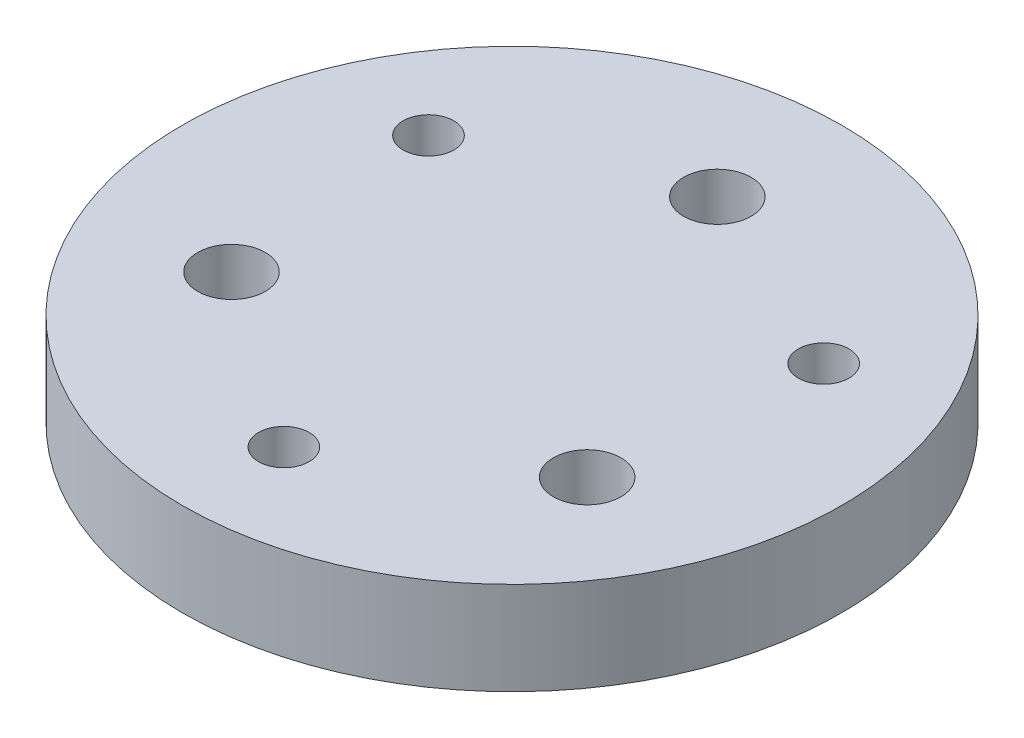
ISO-10303-21;
HEADER;
FILE_DESCRIPTION(('STEP AP214'),'2;1');
FILE_NAME('part.step','',(''),(''),'','','');
FILE_SCHEMA(('AUTOMOTIVE_DESIGN { 1 0 10303 214 1 1 1 1 }'));
ENDSEC;
DATA;
#1=APPLICATION_CONTEXT('core data for automotive mechanical design processes');
#2=APPLICATION_PROTOCOL_DEFINITION('international standard','automotive_design',2000,#1);
#3=PRODUCT_CONTEXT('',#1,'mechanical');
#4=PRODUCT('Part','Part','',(#3));
#5=PRODUCT_RELATED_PRODUCT_CATEGORY('part','',(#4));
#6=PRODUCT_DEFINITION_FORMATION('','',#4);
#7=PRODUCT_DEFINITION_CONTEXT('part definition',#1,'design');
#8=PRODUCT_DEFINITION('design','',#6,#7);
#9=PRODUCT_DEFINITION_SHAPE('','',#8);
#10=(LENGTH_UNIT() NAMED_UNIT(*) SI_UNIT(.MILLI.,.METRE.));
#11=(NAMED_UNIT(*) PLANE_ANGLE_UNIT() SI_UNIT($,.RADIAN.));
#12=(NAMED_UNIT(*) SI_UNIT($,.STERADIAN.) SOLID_ANGLE_UNIT());
#13=UNCERTAINTY_MEASURE_WITH_UNIT(LENGTH_MEASURE(1.E-05),#10,'distance_accuracy_value','');
#14=(GEOMETRIC_REPRESENTATION_CONTEXT(3) GLOBAL_UNCERTAINTY_ASSIGNED_CONTEXT((#13)) GLOBAL_UNIT_ASSIGNED_CONTEXT((#10,
#11,#12)) REPRESENTATION_CONTEXT('',''));
#15=CARTESIAN_POINT('',(0.,0.,0.));
#16=DIRECTION('',(0.,0.,1.));
#17=DIRECTION('',(1.,0.,0.));
#18=AXIS2_PLACEMENT_3D('',#15,#16,#17);
#19=CARTESIAN_POINT('',(0.,5.5,0.));
#20=DIRECTION('',(0.,1.,0.));
#21=DIRECTION('',(0.,0.,1.));
#22=AXIS2_PLACEMENT_3D('',#19,#20,#21);
#23=PLANE('',#22);
#24=CARTESIAN_POINT('',(0.,5.5,13.5));
#25=DIRECTION('',(0.,1.,0.));
#26=DIRECTION('',(0.,0.,1.));
#27=AXIS2_PLACEMENT_3D('',#24,#25,#26);
#28=CIRCLE('',#27,1.5);
#29=CARTESIAN_POINT('',(0.,5.5,15.));
#30=VERTEX_POINT('',#29);
#31=EDGE_CURVE('E65',#30,#30,#28,.T.);
#32=ORIENTED_EDGE('',*,*,#31,.F.);
#33=EDGE_LOOP('',(#32));
#34=FACE_BOUND('',#33,.T.);
#35=CARTESIAN_POINT('',(10.5222086559809,5.5,6.075));
#36=DIRECTION('',(0.,1.,0.));
#37=DIRECTION('',(0.,0.,1.));
#38=AXIS2_PLACEMENT_3D('',#35,#36,#37);
#39=CIRCLE('',#38,2.);
#40=CARTESIAN_POINT('',(10.5222086559809,5.5,8.075));
#41=VERTEX_POINT('',#40);
#42=EDGE_CURVE('E53',#41,#41,#39,.T.);
#43=ORIENTED_EDGE('',*,*,#42,.F.);
#44=EDGE_LOOP('',(#43));
#45=FACE_BOUND('',#44,.T.);
#46=CARTESIAN_POINT('',(0.,5.5,-12.15));
#47=DIRECTION('',(0.,1.,0.));
#48=DIRECTION('',(0.,0.,1.));
#49=AXIS2_PLACEMENT_3D('',#46,#47,#48);
#50=CIRCLE('',#49,2.);
#51=CARTESIAN_POINT('',(0.,5.5,-10.15));
#52=VERTEX_POINT('',#51);
#53=EDGE_CURVE('E42',#52,#52,#50,.T.);
#54=ORIENTED_EDGE('',*,*,#53,.F.);
#55=EDGE_LOOP('',(#54));
#56=FACE_BOUND('',#55,.T.);
#57=CARTESIAN_POINT('',(0.,5.5,0.));
#58=DIRECTION('',(0.,1.,0.));
#59=DIRECTION('',(0.,0.,1.));
#60=AXIS2_PLACEMENT_3D('',#57,#58,#59);
#61=CIRCLE('',#60,19.5);
#62=CARTESIAN_POINT('',(0.,5.5,19.5));
#63=VERTEX_POINT('',#62);
#64=EDGE_CURVE('E10',#63,#63,#61,.T.);
#65=ORIENTED_EDGE('',*,*,#64,.T.);
#66=EDGE_LOOP('',(#65));
#67=FACE_BOUND('',#66,.T.);
#68=CARTESIAN_POINT('',(-10.5222086559809,5.5,6.075));
#69=DIRECTION('',(0.,1.,0.));
#70=DIRECTION('',(0.,0.,1.));
#71=AXIS2_PLACEMENT_3D('',#68,#69,#70);
#72=CIRCLE('',#71,2.);
#73=CARTESIAN_POINT('',(-10.5222086559809,5.5,8.075));
#74=VERTEX_POINT('',#73);
#75=EDGE_CURVE('E47',#74,#74,#72,.T.);
#76=ORIENTED_EDGE('',*,*,#75,.F.);
#77=EDGE_LOOP('',(#76));
#78=FACE_BOUND('',#77,.T.);
#79=CARTESIAN_POINT('',(-11.6913429510899,5.5,-6.75000000000001));
#80=DIRECTION('',(0.,1.,0.));
#81=DIRECTION('',(0.,0.,1.));
#82=AXIS2_PLACEMENT_3D('',#79,#80,#81);
#83=CIRCLE('',#82,1.5);
#84=CARTESIAN_POINT('',(-11.6913429510899,5.5,-5.25000000000001));
#85=VERTEX_POINT('',#84);
#86=EDGE_CURVE('E59',#85,#85,#83,.T.);
#87=ORIENTED_EDGE('',*,*,#86,.F.);
#88=EDGE_LOOP('',(#87));
#89=FACE_BOUND('',#88,.T.);
#90=CARTESIAN_POINT('',(11.6913429510899,5.5,-6.75000000000001));
#91=DIRECTION('',(0.,1.,0.));
#92=DIRECTION('',(0.,0.,1.));
#93=AXIS2_PLACEMENT_3D('',#90,#91,#92);
#94=CIRCLE('',#93,1.5);
#95=CARTESIAN_POINT('',(11.6913429510899,5.5,-5.25000000000001));
#96=VERTEX_POINT('',#95);
#97=EDGE_CURVE('E71',#96,#96,#94,.T.);
#98=ORIENTED_EDGE('',*,*,#97,.F.);
#99=EDGE_LOOP('',(#98));
#100=FACE_BOUND('',#99,.T.);
#101=ADVANCED_FACE('F31',(#34,#45,#56,#67,#78,#89,#100),#23,.T.);
#102=CARTESIAN_POINT('',(0.,0.,0.));
#103=DIRECTION('',(0.,1.,0.));
#104=DIRECTION('',(0.,0.,1.));
#105=AXIS2_PLACEMENT_3D('',#102,#103,#104);
#106=PLANE('',#105);
#107=CARTESIAN_POINT('',(0.,0.,0.));
#108=DIRECTION('',(0.,1.,0.));
#109=DIRECTION('',(0.,0.,1.));
#110=AXIS2_PLACEMENT_3D('',#107,#108,#109);
#111=CIRCLE('',#110,19.5);
#112=CARTESIAN_POINT('',(0.,0.,19.5));
#113=VERTEX_POINT('',#112);
#114=EDGE_CURVE('E35',#113,#113,#111,.T.);
#115=ORIENTED_EDGE('',*,*,#114,.F.);
#116=EDGE_LOOP('',(#115));
#117=FACE_BOUND('',#116,.T.);
#118=CARTESIAN_POINT('',(0.,0.,-12.15));
#119=DIRECTION('',(0.,1.,0.));
#120=DIRECTION('',(0.,0.,1.));
#121=AXIS2_PLACEMENT_3D('',#118,#119,#120);
#122=CIRCLE('',#121,2.);
#123=CARTESIAN_POINT('',(0.,0.,-10.15));
#124=VERTEX_POINT('',#123);
#125=EDGE_CURVE('E44',#124,#124,#122,.T.);
#126=ORIENTED_EDGE('',*,*,#125,.T.);
#127=EDGE_LOOP('',(#126));
#128=FACE_BOUND('',#127,.T.);
#129=CARTESIAN_POINT('',(-10.5222086559809,0.,6.075));
#130=DIRECTION('',(0.,1.,0.));
#131=DIRECTION('',(0.,0.,1.));
#132=AXIS2_PLACEMENT_3D('',#129,#130,#131);
#133=CIRCLE('',#132,2.);
#134=CARTESIAN_POINT('',(-10.5222086559809,0.,8.075));
#135=VERTEX_POINT('',#134);
#136=EDGE_CURVE('E50',#135,#135,#133,.T.);
#137=ORIENTED_EDGE('',*,*,#136,.T.);
#138=EDGE_LOOP('',(#137));
#139=FACE_BOUND('',#138,.T.);
#140=CARTESIAN_POINT('',(10.5222086559809,0.,6.075));
#141=DIRECTION('',(0.,1.,0.));
#142=DIRECTION('',(0.,0.,1.));
#143=AXIS2_PLACEMENT_3D('',#140,#141,#142);
#144=CIRCLE('',#143,2.);
#145=CARTESIAN_POINT('',(10.5222086559809,0.,8.075));
#146=VERTEX_POINT('',#145);
#147=EDGE_CURVE('E56',#146,#146,#144,.T.);
#148=ORIENTED_EDGE('',*,*,#147,.T.);
#149=EDGE_LOOP('',(#148));
#150=FACE_BOUND('',#149,.T.);
#151=CARTESIAN_POINT('',(-11.6913429510899,0.,-6.75000000000001));
#152=DIRECTION('',(0.,1.,0.));
#153=DIRECTION('',(0.,0.,1.));
#154=AXIS2_PLACEMENT_3D('',#151,#152,#153);
#155=CIRCLE('',#154,1.5);
#156=CARTESIAN_POINT('',(-11.6913429510899,0.,-5.25000000000001));
#157=VERTEX_POINT('',#156);
#158=EDGE_CURVE('E62',#157,#157,#155,.T.);
#159=ORIENTED_EDGE('',*,*,#158,.T.);
#160=EDGE_LOOP('',(#159));
#161=FACE_BOUND('',#160,.T.);
#162=CARTESIAN_POINT('',(0.,0.,13.5));
#163=DIRECTION('',(0.,1.,0.));
#164=DIRECTION('',(0.,0.,1.));
#165=AXIS2_PLACEMENT_3D('',#162,#163,#164);
#166=CIRCLE('',#165,1.5);
#167=CARTESIAN_POINT('',(0.,0.,15.));
#168=VERTEX_POINT('',#167);
#169=EDGE_CURVE('E68',#168,#168,#166,.T.);
#170=ORIENTED_EDGE('',*,*,#169,.T.);
#171=EDGE_LOOP('',(#170));
#172=FACE_BOUND('',#171,.T.);
#173=CARTESIAN_POINT('',(11.6913429510899,0.,-6.75000000000001));
#174=DIRECTION('',(0.,1.,0.));
#175=DIRECTION('',(0.,0.,1.));
#176=AXIS2_PLACEMENT_3D('',#173,#174,#175);
#177=CIRCLE('',#176,1.5);
#178=CARTESIAN_POINT('',(11.6913429510899,0.,-5.25000000000001));
#179=VERTEX_POINT('',#178);
#180=EDGE_CURVE('E74',#179,#179,#177,.T.);
#181=ORIENTED_EDGE('',*,*,#180,.T.);
#182=EDGE_LOOP('',(#181));
#183=FACE_BOUND('',#182,.T.);
#184=ADVANCED_FACE('F84',(#117,#128,#139,#150,#161,#172,#183),#106,.F.);
#185=CARTESIAN_POINT('',(0.,5.5,0.));
#186=DIRECTION('',(0.,-1.,0.));
#187=DIRECTION('',(0.,0.,-1.));
#188=AXIS2_PLACEMENT_3D('',#185,#186,#187);
#189=CYLINDRICAL_SURFACE('',#188,19.5);
#190=ORIENTED_EDGE('',*,*,#64,.F.);
#191=EDGE_LOOP('',(#190));
#192=FACE_BOUND('',#191,.T.);
#193=ORIENTED_EDGE('',*,*,#114,.T.);
#194=EDGE_LOOP('',(#193));
#195=FACE_BOUND('',#194,.T.);
#196=ADVANCED_FACE('F33',(#192,#195),#189,.T.);
#197=CARTESIAN_POINT('',(0.,5.5,-12.15));
#198=DIRECTION('',(0.,-1.,0.));
#199=DIRECTION('',(0.,0.,-1.));
#200=AXIS2_PLACEMENT_3D('',#197,#198,#199);
#201=CYLINDRICAL_SURFACE('',#200,2.);
#202=ORIENTED_EDGE('',*,*,#53,.T.);
#203=EDGE_LOOP('',(#202));
#204=FACE_BOUND('',#203,.T.);
#205=ORIENTED_EDGE('',*,*,#125,.F.);
#206=EDGE_LOOP('',(#205));
#207=FACE_BOUND('',#206,.T.);
#208=ADVANCED_FACE('F94',(#204,#207),#201,.F.);
#209=CARTESIAN_POINT('',(-10.5222086559809,5.5,6.075));
#210=DIRECTION('',(0.,-1.,0.));
#211=DIRECTION('',(0.,0.,-1.));
#212=AXIS2_PLACEMENT_3D('',#209,#210,#211);
#213=CYLINDRICAL_SURFACE('',#212,2.);
#214=ORIENTED_EDGE('',*,*,#75,.T.);
#215=EDGE_LOOP('',(#214));
#216=FACE_BOUND('',#215,.T.);
#217=ORIENTED_EDGE('',*,*,#136,.F.);
#218=EDGE_LOOP('',(#217));
#219=FACE_BOUND('',#218,.T.);
#220=ADVANCED_FACE('F97',(#216,#219),#213,.F.);
#221=CARTESIAN_POINT('',(10.5222086559809,5.5,6.075));
#222=DIRECTION('',(0.,-1.,0.));
#223=DIRECTION('',(0.,0.,-1.));
#224=AXIS2_PLACEMENT_3D('',#221,#222,#223);
#225=CYLINDRICAL_SURFACE('',#224,2.);
#226=ORIENTED_EDGE('',*,*,#42,.T.);
#227=EDGE_LOOP('',(#226));
#228=FACE_BOUND('',#227,.T.);
#229=ORIENTED_EDGE('',*,*,#147,.F.);
#230=EDGE_LOOP('',(#229));
#231=FACE_BOUND('',#230,.T.);
#232=ADVANCED_FACE('F101',(#228,#231),#225,.F.);
#233=CARTESIAN_POINT('',(-11.6913429510899,5.5,-6.75000000000001));
#234=DIRECTION('',(0.,-1.,0.));
#235=DIRECTION('',(0.,0.,-1.));
#236=AXIS2_PLACEMENT_3D('',#233,#234,#235);
#237=CYLINDRICAL_SURFACE('',#236,1.5);
#238=ORIENTED_EDGE('',*,*,#86,.T.);
#239=EDGE_LOOP('',(#238));
#240=FACE_BOUND('',#239,.T.);
#241=ORIENTED_EDGE('',*,*,#158,.F.);
#242=EDGE_LOOP('',(#241));
#243=FACE_BOUND('',#242,.T.);
#244=ADVANCED_FACE('F105',(#240,#243),#237,.F.);
#245=CARTESIAN_POINT('',(0.,5.5,13.5));
#246=DIRECTION('',(0.,-1.,0.));
#247=DIRECTION('',(0.,0.,-1.));
#248=AXIS2_PLACEMENT_3D('',#245,#246,#247);
#249=CYLINDRICAL_SURFACE('',#248,1.5);
#250=ORIENTED_EDGE('',*,*,#31,.T.);
#251=EDGE_LOOP('',(#250));
#252=FACE_BOUND('',#251,.T.);
#253=ORIENTED_EDGE('',*,*,#169,.F.);
#254=EDGE_LOOP('',(#253));
#255=FACE_BOUND('',#254,.T.);
#256=ADVANCED_FACE('F109',(#252,#255),#249,.F.);
#257=CARTESIAN_POINT('',(11.6913429510899,5.5,-6.75000000000001));
#258=DIRECTION('',(0.,-1.,0.));
#259=DIRECTION('',(0.,0.,-1.));
#260=AXIS2_PLACEMENT_3D('',#257,#258,#259);
#261=CYLINDRICAL_SURFACE('',#260,1.5);
#262=ORIENTED_EDGE('',*,*,#97,.T.);
#263=EDGE_LOOP('',(#262));
#264=FACE_BOUND('',#263,.T.);
#265=ORIENTED_EDGE('',*,*,#180,.F.);
#266=EDGE_LOOP('',(#265));
#267=FACE_BOUND('',#266,.T.);
#268=ADVANCED_FACE('F80',(#264,#267),#261,.F.);
#269=CLOSED_SHELL('',(#101,#184,#196,#208,#220,#232,#244,#256,#268));
#270=MANIFOLD_SOLID_BREP('B2',#269);
#271=ADVANCED_BREP_SHAPE_REPRESENTATION('',(#18,#270),#14);
#272=SHAPE_DEFINITION_REPRESENTATION(#9,#271);
ENDSEC;
END-ISO-10303-21;
